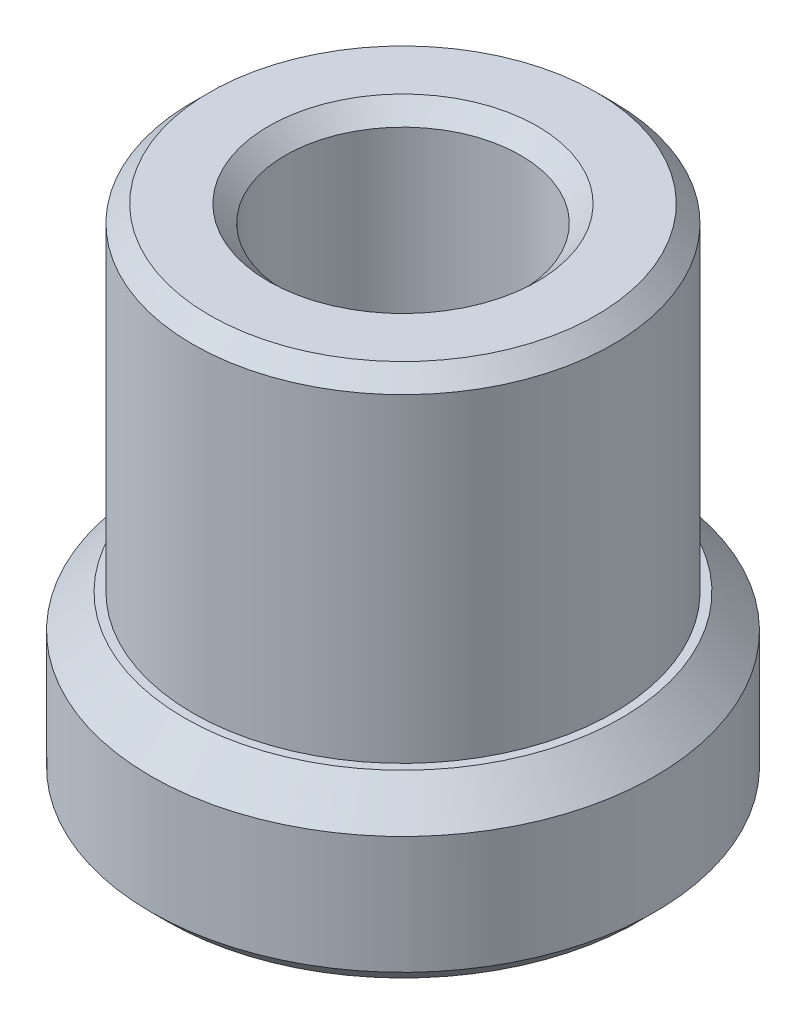
ISO-10303-21;
HEADER;
FILE_DESCRIPTION(('STEP AP214'),'2;1');
FILE_NAME('part.step','',(''),(''),'','','');
FILE_SCHEMA(('AUTOMOTIVE_DESIGN { 1 0 10303 214 1 1 1 1 }'));
ENDSEC;
DATA;
#1=APPLICATION_CONTEXT('core data for automotive mechanical design processes');
#2=APPLICATION_PROTOCOL_DEFINITION('international standard','automotive_design',2000,#1);
#3=PRODUCT_CONTEXT('',#1,'mechanical');
#4=PRODUCT('Part','Part','',(#3));
#5=PRODUCT_RELATED_PRODUCT_CATEGORY('part','',(#4));
#6=PRODUCT_DEFINITION_FORMATION('','',#4);
#7=PRODUCT_DEFINITION_CONTEXT('part definition',#1,'design');
#8=PRODUCT_DEFINITION('design','',#6,#7);
#9=PRODUCT_DEFINITION_SHAPE('','',#8);
#10=(LENGTH_UNIT() NAMED_UNIT(*) SI_UNIT(.MILLI.,.METRE.));
#11=(NAMED_UNIT(*) PLANE_ANGLE_UNIT() SI_UNIT($,.RADIAN.));
#12=(NAMED_UNIT(*) SI_UNIT($,.STERADIAN.) SOLID_ANGLE_UNIT());
#13=UNCERTAINTY_MEASURE_WITH_UNIT(LENGTH_MEASURE(1.E-05),#10,'distance_accuracy_value','');
#14=(GEOMETRIC_REPRESENTATION_CONTEXT(3) GLOBAL_UNCERTAINTY_ASSIGNED_CONTEXT((#13)) GLOBAL_UNIT_ASSIGNED_CONTEXT((#10,
#11,#12)) REPRESENTATION_CONTEXT('',''));
#15=CARTESIAN_POINT('',(0.,0.,0.));
#16=DIRECTION('',(0.,0.,1.));
#17=DIRECTION('',(1.,0.,0.));
#18=AXIS2_PLACEMENT_3D('',#15,#16,#17);
#19=CARTESIAN_POINT('',(0.,0.,0.));
#20=DIRECTION('',(0.,-1.,0.));
#21=DIRECTION('',(0.,0.,-1.));
#22=AXIS2_PLACEMENT_3D('',#19,#20,#21);
#23=PLANE('',#22);
#24=CARTESIAN_POINT('',(0.,0.,0.));
#25=DIRECTION('',(0.,-1.,0.));
#26=DIRECTION('',(0.,0.,-1.));
#27=AXIS2_PLACEMENT_3D('',#24,#25,#26);
#28=CIRCLE('',#27,8.);
#29=CARTESIAN_POINT('',(0.,0.,-8.));
#30=VERTEX_POINT('',#29);
#31=EDGE_CURVE('E44',#30,#30,#28,.F.);
#32=ORIENTED_EDGE('',*,*,#31,.T.);
#33=EDGE_LOOP('',(#32));
#34=FACE_BOUND('',#33,.T.);
#35=CARTESIAN_POINT('',(0.,0.,0.));
#36=DIRECTION('',(0.,-1.,0.));
#37=DIRECTION('',(0.,0.,-1.));
#38=AXIS2_PLACEMENT_3D('',#35,#36,#37);
#39=CIRCLE('',#38,14.);
#40=CARTESIAN_POINT('',(0.,0.,-14.));
#41=VERTEX_POINT('',#40);
#42=EDGE_CURVE('E69',#41,#41,#39,.T.);
#43=ORIENTED_EDGE('',*,*,#42,.T.);
#44=EDGE_LOOP('',(#43));
#45=FACE_BOUND('',#44,.T.);
#46=ADVANCED_FACE('F37',(#34,#45),#23,.T.);
#47=CARTESIAN_POINT('',(0.,30.,0.));
#48=DIRECTION('',(0.,1.,0.));
#49=DIRECTION('',(0.,0.,1.));
#50=AXIS2_PLACEMENT_3D('',#47,#48,#49);
#51=CYLINDRICAL_SURFACE('',#50,15.);
#52=CARTESIAN_POINT('',(0.,8.,0.));
#53=DIRECTION('',(0.,1.,0.));
#54=DIRECTION('',(0.,0.,1.));
#55=AXIS2_PLACEMENT_3D('',#52,#53,#54);
#56=CIRCLE('',#55,15.);
#57=CARTESIAN_POINT('',(0.,8.,15.));
#58=VERTEX_POINT('',#57);
#59=EDGE_CURVE('E57',#58,#58,#56,.F.);
#60=ORIENTED_EDGE('',*,*,#59,.T.);
#61=EDGE_LOOP('',(#60));
#62=FACE_BOUND('',#61,.T.);
#63=CARTESIAN_POINT('',(0.,1.00000000000001,0.));
#64=DIRECTION('',(0.,-1.,0.));
#65=DIRECTION('',(0.,0.,-1.));
#66=AXIS2_PLACEMENT_3D('',#63,#64,#65);
#67=CIRCLE('',#66,15.);
#68=CARTESIAN_POINT('',(0.,1.00000000000001,-15.));
#69=VERTEX_POINT('',#68);
#70=EDGE_CURVE('E72',#69,#69,#67,.F.);
#71=ORIENTED_EDGE('',*,*,#70,.T.);
#72=EDGE_LOOP('',(#71));
#73=FACE_BOUND('',#72,.T.);
#74=ADVANCED_FACE('F83',(#62,#73),#51,.T.);
#75=CARTESIAN_POINT('',(-15.,10.,0.));
#76=DIRECTION('',(0.,1.,0.));
#77=DIRECTION('',(0.,0.,1.));
#78=AXIS2_PLACEMENT_3D('',#75,#76,#77);
#79=PLANE('',#78);
#80=CARTESIAN_POINT('',(0.,10.,0.));
#81=DIRECTION('',(0.,1.,0.));
#82=DIRECTION('',(0.,0.,1.));
#83=AXIS2_PLACEMENT_3D('',#80,#81,#82);
#84=CIRCLE('',#83,13.);
#85=CARTESIAN_POINT('',(0.,10.,13.));
#86=VERTEX_POINT('',#85);
#87=EDGE_CURVE('E60',#86,#86,#84,.T.);
#88=ORIENTED_EDGE('',*,*,#87,.T.);
#89=EDGE_LOOP('',(#88));
#90=FACE_BOUND('',#89,.T.);
#91=CARTESIAN_POINT('',(0.,10.,0.));
#92=DIRECTION('',(0.,1.,0.));
#93=DIRECTION('',(0.,0.,1.));
#94=AXIS2_PLACEMENT_3D('',#91,#92,#93);
#95=CIRCLE('',#94,12.5);
#96=CARTESIAN_POINT('',(0.,10.,12.5));
#97=VERTEX_POINT('',#96);
#98=EDGE_CURVE('E75',#97,#97,#95,.T.);
#99=ORIENTED_EDGE('',*,*,#98,.F.);
#100=EDGE_LOOP('',(#99));
#101=FACE_BOUND('',#100,.T.);
#102=ADVANCED_FACE('F81',(#90,#101),#79,.T.);
#103=CARTESIAN_POINT('',(0.,30.,0.));
#104=DIRECTION('',(0.,1.,0.));
#105=DIRECTION('',(0.,0.,1.));
#106=AXIS2_PLACEMENT_3D('',#103,#104,#105);
#107=CYLINDRICAL_SURFACE('',#106,12.5);
#108=CARTESIAN_POINT('',(0.,29.,0.));
#109=DIRECTION('',(0.,1.,0.));
#110=DIRECTION('',(0.,0.,1.));
#111=AXIS2_PLACEMENT_3D('',#108,#109,#110);
#112=CIRCLE('',#111,12.5);
#113=CARTESIAN_POINT('',(0.,29.,12.5));
#114=VERTEX_POINT('',#113);
#115=EDGE_CURVE('E63',#114,#114,#112,.F.);
#116=ORIENTED_EDGE('',*,*,#115,.T.);
#117=EDGE_LOOP('',(#116));
#118=FACE_BOUND('',#117,.T.);
#119=ORIENTED_EDGE('',*,*,#98,.T.);
#120=EDGE_LOOP('',(#119));
#121=FACE_BOUND('',#120,.T.);
#122=ADVANCED_FACE('F79',(#118,#121),#107,.T.);
#123=CARTESIAN_POINT('',(-12.5,30.,0.));
#124=DIRECTION('',(0.,1.,0.));
#125=DIRECTION('',(0.,0.,1.));
#126=AXIS2_PLACEMENT_3D('',#123,#124,#125);
#127=PLANE('',#126);
#128=CARTESIAN_POINT('',(0.,30.,0.));
#129=DIRECTION('',(0.,1.,0.));
#130=DIRECTION('',(0.,0.,1.));
#131=AXIS2_PLACEMENT_3D('',#128,#129,#130);
#132=CIRCLE('',#131,7.99999999999999);
#133=CARTESIAN_POINT('',(0.,30.,7.99999999999999));
#134=VERTEX_POINT('',#133);
#135=EDGE_CURVE('E10',#134,#134,#132,.F.);
#136=ORIENTED_EDGE('',*,*,#135,.T.);
#137=EDGE_LOOP('',(#136));
#138=FACE_BOUND('',#137,.T.);
#139=CARTESIAN_POINT('',(0.,30.,0.));
#140=DIRECTION('',(0.,1.,0.));
#141=DIRECTION('',(0.,0.,1.));
#142=AXIS2_PLACEMENT_3D('',#139,#140,#141);
#143=CIRCLE('',#142,11.5);
#144=CARTESIAN_POINT('',(0.,30.,11.5));
#145=VERTEX_POINT('',#144);
#146=EDGE_CURVE('E66',#145,#145,#143,.T.);
#147=ORIENTED_EDGE('',*,*,#146,.T.);
#148=EDGE_LOOP('',(#147));
#149=FACE_BOUND('',#148,.T.);
#150=ADVANCED_FACE('F90',(#138,#149),#127,.T.);
#151=CARTESIAN_POINT('',(0.,1.00000000000001,0.));
#152=DIRECTION('',(0.,1.,0.));
#153=DIRECTION('',(0.,0.,1.));
#154=AXIS2_PLACEMENT_3D('',#151,#152,#153);
#155=CONICAL_SURFACE('',#154,15.,0.785398163397448);
#156=ORIENTED_EDGE('',*,*,#42,.F.);
#157=EDGE_LOOP('',(#156));
#158=FACE_BOUND('',#157,.T.);
#159=ORIENTED_EDGE('',*,*,#70,.F.);
#160=EDGE_LOOP('',(#159));
#161=FACE_BOUND('',#160,.T.);
#162=ADVANCED_FACE('F101',(#158,#161),#155,.T.);
#163=CARTESIAN_POINT('',(0.,30.,0.));
#164=DIRECTION('',(0.,-1.,0.));
#165=DIRECTION('',(0.,0.,-1.));
#166=AXIS2_PLACEMENT_3D('',#163,#164,#165);
#167=CONICAL_SURFACE('',#166,11.5,0.785398163397446);
#168=ORIENTED_EDGE('',*,*,#115,.F.);
#169=EDGE_LOOP('',(#168));
#170=FACE_BOUND('',#169,.T.);
#171=ORIENTED_EDGE('',*,*,#146,.F.);
#172=EDGE_LOOP('',(#171));
#173=FACE_BOUND('',#172,.T.);
#174=ADVANCED_FACE('F104',(#170,#173),#167,.T.);
#175=CARTESIAN_POINT('',(0.,10.,0.));
#176=DIRECTION('',(0.,-1.,0.));
#177=DIRECTION('',(0.,0.,-1.));
#178=AXIS2_PLACEMENT_3D('',#175,#176,#177);
#179=CONICAL_SURFACE('',#178,13.,0.785398163397447);
#180=ORIENTED_EDGE('',*,*,#59,.F.);
#181=EDGE_LOOP('',(#180));
#182=FACE_BOUND('',#181,.T.);
#183=ORIENTED_EDGE('',*,*,#87,.F.);
#184=EDGE_LOOP('',(#183));
#185=FACE_BOUND('',#184,.T.);
#186=ADVANCED_FACE('F108',(#182,#185),#179,.T.);
#187=CARTESIAN_POINT('',(0.,0.,0.));
#188=DIRECTION('',(0.,-1.,0.));
#189=DIRECTION('',(0.,0.,-1.));
#190=AXIS2_PLACEMENT_3D('',#187,#188,#189);
#191=CYLINDRICAL_SURFACE('',#190,6.99999999999999);
#192=CARTESIAN_POINT('',(0.,1.,0.));
#193=DIRECTION('',(0.,-1.,0.));
#194=DIRECTION('',(0.,0.,-1.));
#195=AXIS2_PLACEMENT_3D('',#192,#193,#194);
#196=CIRCLE('',#195,6.99999999999999);
#197=CARTESIAN_POINT('',(0.,1.,-6.99999999999999));
#198=VERTEX_POINT('',#197);
#199=EDGE_CURVE('E48',#198,#198,#196,.T.);
#200=ORIENTED_EDGE('',*,*,#199,.T.);
#201=EDGE_LOOP('',(#200));
#202=FACE_BOUND('',#201,.T.);
#203=CARTESIAN_POINT('',(0.,29.,0.));
#204=DIRECTION('',(0.,1.,0.));
#205=DIRECTION('',(0.,0.,1.));
#206=AXIS2_PLACEMENT_3D('',#203,#204,#205);
#207=CIRCLE('',#206,6.99999999999999);
#208=CARTESIAN_POINT('',(0.,29.,6.99999999999999));
#209=VERTEX_POINT('',#208);
#210=EDGE_CURVE('E52',#209,#209,#207,.T.);
#211=ORIENTED_EDGE('',*,*,#210,.T.);
#212=EDGE_LOOP('',(#211));
#213=FACE_BOUND('',#212,.T.);
#214=ADVANCED_FACE('F111',(#202,#213),#191,.F.);
#215=CARTESIAN_POINT('',(0.,1.,0.));
#216=DIRECTION('',(0.,-1.,0.));
#217=DIRECTION('',(0.,0.,-1.));
#218=AXIS2_PLACEMENT_3D('',#215,#216,#217);
#219=CONICAL_SURFACE('',#218,6.99999999999999,0.785398163397453);
#220=ORIENTED_EDGE('',*,*,#31,.F.);
#221=EDGE_LOOP('',(#220));
#222=FACE_BOUND('',#221,.T.);
#223=ORIENTED_EDGE('',*,*,#199,.F.);
#224=EDGE_LOOP('',(#223));
#225=FACE_BOUND('',#224,.T.);
#226=ADVANCED_FACE('F113',(#222,#225),#219,.F.);
#227=CARTESIAN_POINT('',(0.,29.,0.));
#228=DIRECTION('',(0.,1.,0.));
#229=DIRECTION('',(0.,0.,1.));
#230=AXIS2_PLACEMENT_3D('',#227,#228,#229);
#231=CONICAL_SURFACE('',#230,6.99999999999999,0.785398163397446);
#232=ORIENTED_EDGE('',*,*,#135,.F.);
#233=EDGE_LOOP('',(#232));
#234=FACE_BOUND('',#233,.T.);
#235=ORIENTED_EDGE('',*,*,#210,.F.);
#236=EDGE_LOOP('',(#235));
#237=FACE_BOUND('',#236,.T.);
#238=ADVANCED_FACE('F39',(#234,#237),#231,.F.);
#239=CLOSED_SHELL('',(#46,#74,#102,#122,#150,#162,#174,#186,#214,#226,#238));
#240=MANIFOLD_SOLID_BREP('B2',#239);
#241=ADVANCED_BREP_SHAPE_REPRESENTATION('',(#18,#240),#14);
#242=SHAPE_DEFINITION_REPRESENTATION(#9,#241);
ENDSEC;
END-ISO-10303-21;
